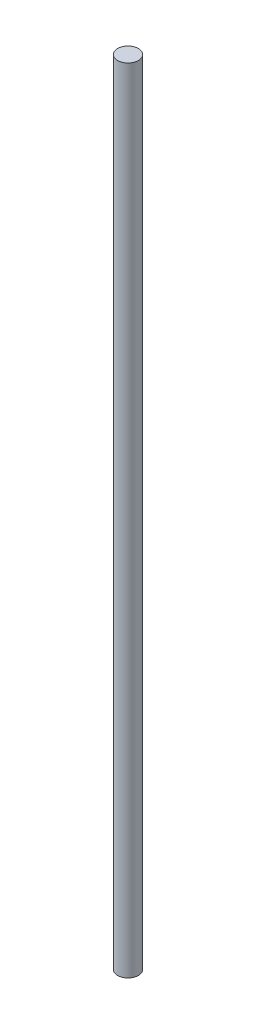
ISO-10303-21;
HEADER;
FILE_DESCRIPTION(('STEP AP214'),'2;1');
FILE_NAME('part.step','',(''),(''),'','','');
FILE_SCHEMA(('AUTOMOTIVE_DESIGN { 1 0 10303 214 1 1 1 1 }'));
ENDSEC;
DATA;
#1=APPLICATION_CONTEXT('core data for automotive mechanical design processes');
#2=APPLICATION_PROTOCOL_DEFINITION('international standard','automotive_design',2000,#1);
#3=PRODUCT_CONTEXT('',#1,'mechanical');
#4=PRODUCT('Part','Part','',(#3));
#5=PRODUCT_RELATED_PRODUCT_CATEGORY('part','',(#4));
#6=PRODUCT_DEFINITION_FORMATION('','',#4);
#7=PRODUCT_DEFINITION_CONTEXT('part definition',#1,'design');
#8=PRODUCT_DEFINITION('design','',#6,#7);
#9=PRODUCT_DEFINITION_SHAPE('','',#8);
#10=(LENGTH_UNIT() NAMED_UNIT(*) SI_UNIT(.MILLI.,.METRE.));
#11=(NAMED_UNIT(*) PLANE_ANGLE_UNIT() SI_UNIT($,.RADIAN.));
#12=(NAMED_UNIT(*) SI_UNIT($,.STERADIAN.) SOLID_ANGLE_UNIT());
#13=UNCERTAINTY_MEASURE_WITH_UNIT(LENGTH_MEASURE(1.E-05),#10,'distance_accuracy_value','');
#14=(GEOMETRIC_REPRESENTATION_CONTEXT(3) GLOBAL_UNCERTAINTY_ASSIGNED_CONTEXT((#13)) GLOBAL_UNIT_ASSIGNED_CONTEXT((#10,
#11,#12)) REPRESENTATION_CONTEXT('',''));
#15=CARTESIAN_POINT('',(0.,0.,0.));
#16=DIRECTION('',(0.,0.,1.));
#17=DIRECTION('',(1.,0.,0.));
#18=AXIS2_PLACEMENT_3D('',#15,#16,#17);
#19=CARTESIAN_POINT('',(0.,304.8,0.));
#20=DIRECTION('',(0.,-1.,0.));
#21=DIRECTION('',(0.,0.,-1.));
#22=AXIS2_PLACEMENT_3D('',#19,#20,#21);
#23=CYLINDRICAL_SURFACE('',#22,4.);
#24=CARTESIAN_POINT('',(0.,304.8,0.));
#25=DIRECTION('',(0.,1.,0.));
#26=DIRECTION('',(0.,0.,1.));
#27=AXIS2_PLACEMENT_3D('',#24,#25,#26);
#28=CIRCLE('',#27,4.);
#29=CARTESIAN_POINT('',(0.,304.8,4.));
#30=VERTEX_POINT('',#29);
#31=EDGE_CURVE('E10',#30,#30,#28,.T.);
#32=ORIENTED_EDGE('',*,*,#31,.F.);
#33=EDGE_LOOP('',(#32));
#34=FACE_BOUND('',#33,.T.);
#35=CARTESIAN_POINT('',(0.,0.,0.));
#36=DIRECTION('',(0.,1.,0.));
#37=DIRECTION('',(0.,0.,1.));
#38=AXIS2_PLACEMENT_3D('',#35,#36,#37);
#39=CIRCLE('',#38,4.);
#40=CARTESIAN_POINT('',(0.,0.,4.));
#41=VERTEX_POINT('',#40);
#42=EDGE_CURVE('E33',#41,#41,#39,.T.);
#43=ORIENTED_EDGE('',*,*,#42,.T.);
#44=EDGE_LOOP('',(#43));
#45=FACE_BOUND('',#44,.T.);
#46=ADVANCED_FACE('F30',(#34,#45),#23,.T.);
#47=CARTESIAN_POINT('',(0.,304.8,0.));
#48=DIRECTION('',(0.,1.,0.));
#49=DIRECTION('',(0.,0.,1.));
#50=AXIS2_PLACEMENT_3D('',#47,#48,#49);
#51=PLANE('',#50);
#52=ORIENTED_EDGE('',*,*,#31,.T.);
#53=EDGE_LOOP('',(#52));
#54=FACE_BOUND('',#53,.T.);
#55=ADVANCED_FACE('F45',(#54),#51,.T.);
#56=CARTESIAN_POINT('',(0.,0.,0.));
#57=DIRECTION('',(0.,1.,0.));
#58=DIRECTION('',(0.,0.,1.));
#59=AXIS2_PLACEMENT_3D('',#56,#57,#58);
#60=PLANE('',#59);
#61=ORIENTED_EDGE('',*,*,#42,.F.);
#62=EDGE_LOOP('',(#61));
#63=FACE_BOUND('',#62,.T.);
#64=ADVANCED_FACE('F43',(#63),#60,.F.);
#65=CLOSED_SHELL('',(#46,#55,#64));
#66=MANIFOLD_SOLID_BREP('B2',#65);
#67=ADVANCED_BREP_SHAPE_REPRESENTATION('',(#18,#66),#14);
#68=SHAPE_DEFINITION_REPRESENTATION(#9,#67);
ENDSEC;
END-ISO-10303-21;
